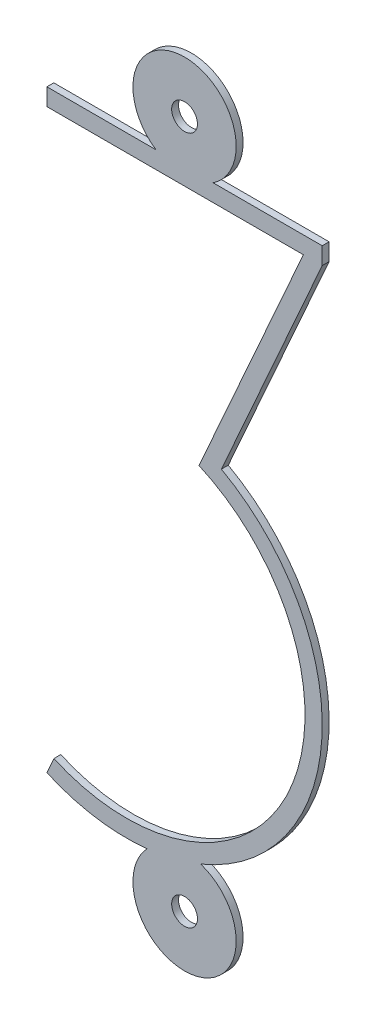
ISO-10303-21;
HEADER;
FILE_DESCRIPTION(('STEP AP214'),'2;1');
FILE_NAME('part.step','',(''),(''),'','','');
FILE_SCHEMA(('AUTOMOTIVE_DESIGN { 1 0 10303 214 1 1 1 1 }'));
ENDSEC;
DATA;
#1=APPLICATION_CONTEXT('core data for automotive mechanical design processes');
#2=APPLICATION_PROTOCOL_DEFINITION('international standard','automotive_design',2000,#1);
#3=PRODUCT_CONTEXT('',#1,'mechanical');
#4=PRODUCT('Part','Part','',(#3));
#5=PRODUCT_RELATED_PRODUCT_CATEGORY('part','',(#4));
#6=PRODUCT_DEFINITION_FORMATION('','',#4);
#7=PRODUCT_DEFINITION_CONTEXT('part definition',#1,'design');
#8=PRODUCT_DEFINITION('design','',#6,#7);
#9=PRODUCT_DEFINITION_SHAPE('','',#8);
#10=(LENGTH_UNIT() NAMED_UNIT(*) SI_UNIT(.MILLI.,.METRE.));
#11=(NAMED_UNIT(*) PLANE_ANGLE_UNIT() SI_UNIT($,.RADIAN.));
#12=(NAMED_UNIT(*) SI_UNIT($,.STERADIAN.) SOLID_ANGLE_UNIT());
#13=UNCERTAINTY_MEASURE_WITH_UNIT(LENGTH_MEASURE(1.E-05),#10,'distance_accuracy_value','');
#14=(GEOMETRIC_REPRESENTATION_CONTEXT(3) GLOBAL_UNCERTAINTY_ASSIGNED_CONTEXT((#13)) GLOBAL_UNIT_ASSIGNED_CONTEXT((#10,
#11,#12)) REPRESENTATION_CONTEXT('',''));
#15=CARTESIAN_POINT('',(0.,0.,0.));
#16=DIRECTION('',(0.,0.,1.));
#17=DIRECTION('',(1.,0.,0.));
#18=AXIS2_PLACEMENT_3D('',#15,#16,#17);
#19=CARTESIAN_POINT('',(-1.68855809367005,-3.31144190632995,0.1));
#20=DIRECTION('',(0.,0.,1.));
#21=DIRECTION('',(1.,0.,0.));
#22=AXIS2_PLACEMENT_3D('',#19,#20,#21);
#23=PLANE('',#22);
#24=CARTESIAN_POINT('',(0.,10.,0.1));
#25=DIRECTION('',(0.,0.,1.));
#26=DIRECTION('',(1.,0.,0.));
#27=AXIS2_PLACEMENT_3D('',#24,#25,#26);
#28=CIRCLE('',#27,0.375);
#29=CARTESIAN_POINT('',(0.375000000000002,10.,0.1));
#30=VERTEX_POINT('',#29);
#31=EDGE_CURVE('E165',#30,#30,#28,.T.);
#32=ORIENTED_EDGE('',*,*,#31,.F.);
#33=EDGE_LOOP('',(#32));
#34=FACE_BOUND('',#33,.T.);
#35=DIRECTION('',(0.,-1.,0.));
#36=VECTOR('',#35,1.);
#37=CARTESIAN_POINT('',(-4.,8.75,0.1));
#38=LINE('',#37,#36);
#39=CARTESIAN_POINT('',(-4.,8.75,0.1));
#40=VERTEX_POINT('',#39);
#41=CARTESIAN_POINT('',(-4.,8.25,0.1));
#42=VERTEX_POINT('',#41);
#43=EDGE_CURVE('E186',#40,#42,#38,.T.);
#44=ORIENTED_EDGE('',*,*,#43,.T.);
#45=DIRECTION('',(1.,0.,0.));
#46=VECTOR('',#45,1.);
#47=CARTESIAN_POINT('',(-4.,8.25,0.1));
#48=LINE('',#47,#46);
#49=CARTESIAN_POINT('',(3.45278977079677,8.25,0.1));
#50=VERTEX_POINT('',#49);
#51=EDGE_CURVE('E109',#42,#50,#48,.T.);
#52=ORIENTED_EDGE('',*,*,#51,.T.);
#53=DIRECTION('',(-0.406331774813376,-0.913725609128371,0.));
#54=VECTOR('',#53,1.);
#55=CARTESIAN_POINT('',(3.45278977079677,8.25,0.1));
#56=LINE('',#55,#54);
#57=CARTESIAN_POINT('',(0.419717925253206,1.42947649830665,0.1));
#58=VERTEX_POINT('',#57);
#59=EDGE_CURVE('E216',#50,#58,#56,.T.);
#60=ORIENTED_EDGE('',*,*,#59,.T.);
#61=CARTESIAN_POINT('',(-1.68855809367005,-3.31144190632995,0.1));
#62=DIRECTION('',(0.,0.,-1.));
#63=DIRECTION('',(1.,0.,0.));
#64=AXIS2_PLACEMENT_3D('',#61,#62,#63);
#65=CIRCLE('',#64,5.18855809367005);
#66=CARTESIAN_POINT('',(-3.79683411259331,-8.05236031096655,0.1));
#67=VERTEX_POINT('',#66);
#68=EDGE_CURVE('E235',#58,#67,#65,.T.);
#69=ORIENTED_EDGE('',*,*,#68,.T.);
#70=DIRECTION('',(-0.406331774813376,-0.913725609128371,0.));
#71=VECTOR('',#70,1.);
#72=CARTESIAN_POINT('',(-4.,-8.50922311553074,0.1));
#73=LINE('',#72,#71);
#74=CARTESIAN_POINT('',(-4.,-8.50922311553074,0.1));
#75=VERTEX_POINT('',#74);
#76=EDGE_CURVE('E232',#67,#75,#73,.T.);
#77=ORIENTED_EDGE('',*,*,#76,.T.);
#78=CARTESIAN_POINT('',(-1.68855809367005,-3.31144190632995,0.1));
#79=DIRECTION('',(0.,0.,1.));
#80=DIRECTION('',(1.,0.,0.));
#81=AXIS2_PLACEMENT_3D('',#78,#79,#80);
#82=CIRCLE('',#81,5.68855809367005);
#83=CARTESIAN_POINT('',(-1.08885039227427,-8.96830003235235,0.1));
#84=VERTEX_POINT('',#83);
#85=EDGE_CURVE('E234',#75,#84,#82,.T.);
#86=ORIENTED_EDGE('',*,*,#85,.T.);
#87=CARTESIAN_POINT('',(0.,-10.,0.1));
#88=DIRECTION('',(0.,0.,1.));
#89=DIRECTION('',(1.,0.,0.));
#90=AXIS2_PLACEMENT_3D('',#87,#88,#89);
#91=CIRCLE('',#90,1.5);
#92=CARTESIAN_POINT('',(0.468669320799945,-8.5750968216258,0.1));
#93=VERTEX_POINT('',#92);
#94=EDGE_CURVE('E237',#84,#93,#91,.T.);
#95=ORIENTED_EDGE('',*,*,#94,.T.);
#96=CARTESIAN_POINT('',(-1.68855809367005,-3.31144190632995,0.1));
#97=DIRECTION('',(0.,0.,1.));
#98=DIRECTION('',(1.,0.,0.));
#99=AXIS2_PLACEMENT_3D('',#96,#97,#98);
#100=CIRCLE('',#99,5.68855809367005);
#101=CARTESIAN_POINT('',(1.07080059765104,1.66305633949241,0.1));
#102=VERTEX_POINT('',#101);
#103=EDGE_CURVE('E243',#93,#102,#100,.T.);
#104=ORIENTED_EDGE('',*,*,#103,.T.);
#105=DIRECTION('',(0.406331774813376,0.913725609128371,0.));
#106=VECTOR('',#105,1.);
#107=CARTESIAN_POINT('',(4.,8.25,0.1));
#108=LINE('',#107,#106);
#109=CARTESIAN_POINT('',(4.,8.25,0.1));
#110=VERTEX_POINT('',#109);
#111=EDGE_CURVE('E245',#102,#110,#108,.T.);
#112=ORIENTED_EDGE('',*,*,#111,.T.);
#113=DIRECTION('',(0.,1.,0.));
#114=VECTOR('',#113,1.);
#115=CARTESIAN_POINT('',(4.,8.75,0.1));
#116=LINE('',#115,#114);
#117=CARTESIAN_POINT('',(4.,8.75,0.1));
#118=VERTEX_POINT('',#117);
#119=EDGE_CURVE('E143',#110,#118,#116,.T.);
#120=ORIENTED_EDGE('',*,*,#119,.T.);
#121=DIRECTION('',(-1.,0.,0.));
#122=VECTOR('',#121,1.);
#123=CARTESIAN_POINT('',(0.829156197588854,8.75,0.1));
#124=LINE('',#123,#122);
#125=CARTESIAN_POINT('',(0.829156197588853,8.75,0.1));
#126=VERTEX_POINT('',#125);
#127=EDGE_CURVE('E137',#118,#126,#124,.T.);
#128=ORIENTED_EDGE('',*,*,#127,.T.);
#129=CARTESIAN_POINT('',(0.,10.,0.1));
#130=DIRECTION('',(0.,0.,1.));
#131=DIRECTION('',(1.,0.,0.));
#132=AXIS2_PLACEMENT_3D('',#129,#130,#131);
#133=CIRCLE('',#132,1.5);
#134=CARTESIAN_POINT('',(-0.829156197588848,8.75,0.1));
#135=VERTEX_POINT('',#134);
#136=EDGE_CURVE('E141',#126,#135,#133,.T.);
#137=ORIENTED_EDGE('',*,*,#136,.T.);
#138=DIRECTION('',(-1.,0.,0.));
#139=VECTOR('',#138,1.);
#140=CARTESIAN_POINT('',(-4.,8.75,0.1));
#141=LINE('',#140,#139);
#142=EDGE_CURVE('E51',#135,#40,#141,.T.);
#143=ORIENTED_EDGE('',*,*,#142,.T.);
#144=EDGE_LOOP('',(#44,#52,#60,#69,#77,#86,#95,#104,#112,#120,#128,#137,#143));
#145=FACE_BOUND('',#144,.T.);
#146=CARTESIAN_POINT('',(0.,-10.,0.1));
#147=DIRECTION('',(0.,0.,1.));
#148=DIRECTION('',(1.,0.,0.));
#149=AXIS2_PLACEMENT_3D('',#146,#147,#148);
#150=CIRCLE('',#149,0.375);
#151=CARTESIAN_POINT('',(0.375,-10.,0.1));
#152=VERTEX_POINT('',#151);
#153=EDGE_CURVE('E287',#152,#152,#150,.T.);
#154=ORIENTED_EDGE('',*,*,#153,.F.);
#155=EDGE_LOOP('',(#154));
#156=FACE_BOUND('',#155,.T.);
#157=ADVANCED_FACE('F34',(#34,#145,#156),#23,.T.);
#158=CARTESIAN_POINT('',(-1.68855809367005,-3.31144190632995,-0.1));
#159=DIRECTION('',(0.,0.,1.));
#160=DIRECTION('',(1.,0.,0.));
#161=AXIS2_PLACEMENT_3D('',#158,#159,#160);
#162=PLANE('',#161);
#163=DIRECTION('',(0.,-1.,0.));
#164=VECTOR('',#163,1.);
#165=CARTESIAN_POINT('',(-4.,8.75,-0.1));
#166=LINE('',#165,#164);
#167=CARTESIAN_POINT('',(-4.,8.75,-0.1));
#168=VERTEX_POINT('',#167);
#169=CARTESIAN_POINT('',(-4.,8.25,-0.1));
#170=VERTEX_POINT('',#169);
#171=EDGE_CURVE('E161',#168,#170,#166,.T.);
#172=ORIENTED_EDGE('',*,*,#171,.F.);
#173=DIRECTION('',(-1.,0.,0.));
#174=VECTOR('',#173,1.);
#175=CARTESIAN_POINT('',(-4.,8.75,-0.1));
#176=LINE('',#175,#174);
#177=CARTESIAN_POINT('',(-0.829156197588848,8.75,-0.1));
#178=VERTEX_POINT('',#177);
#179=EDGE_CURVE('E101',#178,#168,#176,.T.);
#180=ORIENTED_EDGE('',*,*,#179,.F.);
#181=CARTESIAN_POINT('',(0.,10.,-0.1));
#182=DIRECTION('',(0.,0.,1.));
#183=DIRECTION('',(1.,0.,0.));
#184=AXIS2_PLACEMENT_3D('',#181,#182,#183);
#185=CIRCLE('',#184,1.5);
#186=CARTESIAN_POINT('',(0.829156197588853,8.75,-0.1));
#187=VERTEX_POINT('',#186);
#188=EDGE_CURVE('E95',#187,#178,#185,.T.);
#189=ORIENTED_EDGE('',*,*,#188,.F.);
#190=DIRECTION('',(-1.,0.,0.));
#191=VECTOR('',#190,1.);
#192=CARTESIAN_POINT('',(0.829156197588854,8.75,-0.1));
#193=LINE('',#192,#191);
#194=CARTESIAN_POINT('',(4.,8.75,-0.1));
#195=VERTEX_POINT('',#194);
#196=EDGE_CURVE('E151',#195,#187,#193,.T.);
#197=ORIENTED_EDGE('',*,*,#196,.F.);
#198=DIRECTION('',(0.,1.,0.));
#199=VECTOR('',#198,1.);
#200=CARTESIAN_POINT('',(4.,8.75,-0.1));
#201=LINE('',#200,#199);
#202=CARTESIAN_POINT('',(4.,8.25,-0.1));
#203=VERTEX_POINT('',#202);
#204=EDGE_CURVE('E181',#203,#195,#201,.T.);
#205=ORIENTED_EDGE('',*,*,#204,.F.);
#206=DIRECTION('',(0.406331774813376,0.913725609128371,0.));
#207=VECTOR('',#206,1.);
#208=CARTESIAN_POINT('',(4.,8.25,-0.1));
#209=LINE('',#208,#207);
#210=CARTESIAN_POINT('',(1.07080059765104,1.66305633949241,-0.1));
#211=VERTEX_POINT('',#210);
#212=EDGE_CURVE('E179',#211,#203,#209,.T.);
#213=ORIENTED_EDGE('',*,*,#212,.F.);
#214=CARTESIAN_POINT('',(-1.68855809367005,-3.31144190632995,-0.1));
#215=DIRECTION('',(0.,0.,1.));
#216=DIRECTION('',(1.,0.,0.));
#217=AXIS2_PLACEMENT_3D('',#214,#215,#216);
#218=CIRCLE('',#217,5.68855809367005);
#219=CARTESIAN_POINT('',(0.468669320799945,-8.5750968216258,-0.1));
#220=VERTEX_POINT('',#219);
#221=EDGE_CURVE('E177',#220,#211,#218,.T.);
#222=ORIENTED_EDGE('',*,*,#221,.F.);
#223=CARTESIAN_POINT('',(0.,-10.,-0.1));
#224=DIRECTION('',(0.,0.,1.));
#225=DIRECTION('',(1.,0.,0.));
#226=AXIS2_PLACEMENT_3D('',#223,#224,#225);
#227=CIRCLE('',#226,1.5);
#228=CARTESIAN_POINT('',(-1.08885039227427,-8.96830003235235,-0.1));
#229=VERTEX_POINT('',#228);
#230=EDGE_CURVE('E175',#229,#220,#227,.T.);
#231=ORIENTED_EDGE('',*,*,#230,.F.);
#232=CARTESIAN_POINT('',(-1.68855809367005,-3.31144190632995,-0.1));
#233=DIRECTION('',(0.,0.,1.));
#234=DIRECTION('',(1.,0.,0.));
#235=AXIS2_PLACEMENT_3D('',#232,#233,#234);
#236=CIRCLE('',#235,5.68855809367005);
#237=CARTESIAN_POINT('',(-4.,-8.50922311553074,-0.1));
#238=VERTEX_POINT('',#237);
#239=EDGE_CURVE('E173',#238,#229,#236,.T.);
#240=ORIENTED_EDGE('',*,*,#239,.F.);
#241=DIRECTION('',(-0.406331774813376,-0.913725609128371,0.));
#242=VECTOR('',#241,1.);
#243=CARTESIAN_POINT('',(-4.,-8.50922311553074,-0.1));
#244=LINE('',#243,#242);
#245=CARTESIAN_POINT('',(-3.79683411259331,-8.05236031096655,-0.1));
#246=VERTEX_POINT('',#245);
#247=EDGE_CURVE('E171',#246,#238,#244,.T.);
#248=ORIENTED_EDGE('',*,*,#247,.F.);
#249=CARTESIAN_POINT('',(-1.68855809367005,-3.31144190632995,-0.1));
#250=DIRECTION('',(0.,0.,-1.));
#251=DIRECTION('',(1.,0.,0.));
#252=AXIS2_PLACEMENT_3D('',#249,#250,#251);
#253=CIRCLE('',#252,5.18855809367005);
#254=CARTESIAN_POINT('',(0.419717925253206,1.42947649830665,-0.1));
#255=VERTEX_POINT('',#254);
#256=EDGE_CURVE('E169',#255,#246,#253,.T.);
#257=ORIENTED_EDGE('',*,*,#256,.F.);
#258=DIRECTION('',(-0.406331774813376,-0.913725609128371,0.));
#259=VECTOR('',#258,1.);
#260=CARTESIAN_POINT('',(3.45278977079677,8.25,-0.1));
#261=LINE('',#260,#259);
#262=CARTESIAN_POINT('',(3.45278977079677,8.25,-0.1));
#263=VERTEX_POINT('',#262);
#264=EDGE_CURVE('E167',#263,#255,#261,.T.);
#265=ORIENTED_EDGE('',*,*,#264,.F.);
#266=DIRECTION('',(1.,0.,0.));
#267=VECTOR('',#266,1.);
#268=CARTESIAN_POINT('',(-4.,8.25,-0.1));
#269=LINE('',#268,#267);
#270=EDGE_CURVE('E164',#170,#263,#269,.T.);
#271=ORIENTED_EDGE('',*,*,#270,.F.);
#272=EDGE_LOOP('',(#172,#180,#189,#197,#205,#213,#222,#231,#240,#248,#257,#265,#271));
#273=FACE_BOUND('',#272,.T.);
#274=CARTESIAN_POINT('',(0.,10.,-0.1));
#275=DIRECTION('',(0.,0.,1.));
#276=DIRECTION('',(1.,0.,0.));
#277=AXIS2_PLACEMENT_3D('',#274,#275,#276);
#278=CIRCLE('',#277,0.375);
#279=CARTESIAN_POINT('',(0.375000000000002,10.,-0.1));
#280=VERTEX_POINT('',#279);
#281=EDGE_CURVE('E293',#280,#280,#278,.T.);
#282=ORIENTED_EDGE('',*,*,#281,.T.);
#283=EDGE_LOOP('',(#282));
#284=FACE_BOUND('',#283,.T.);
#285=CARTESIAN_POINT('',(0.,-10.,-0.1));
#286=DIRECTION('',(0.,0.,1.));
#287=DIRECTION('',(1.,0.,0.));
#288=AXIS2_PLACEMENT_3D('',#285,#286,#287);
#289=CIRCLE('',#288,0.375);
#290=CARTESIAN_POINT('',(0.375,-10.,-0.1));
#291=VERTEX_POINT('',#290);
#292=EDGE_CURVE('E290',#291,#291,#289,.T.);
#293=ORIENTED_EDGE('',*,*,#292,.T.);
#294=EDGE_LOOP('',(#293));
#295=FACE_BOUND('',#294,.T.);
#296=ADVANCED_FACE('F220',(#273,#284,#295),#162,.F.);
#297=CARTESIAN_POINT('',(-4.,8.75,0.1));
#298=DIRECTION('',(1.,0.,0.));
#299=DIRECTION('',(0.,0.,-1.));
#300=AXIS2_PLACEMENT_3D('',#297,#298,#299);
#301=PLANE('',#300);
#302=ORIENTED_EDGE('',*,*,#171,.T.);
#303=DIRECTION('',(0.,0.,-1.));
#304=VECTOR('',#303,1.);
#305=CARTESIAN_POINT('',(-4.,8.25,0.1));
#306=LINE('',#305,#304);
#307=EDGE_CURVE('E11',#42,#170,#306,.T.);
#308=ORIENTED_EDGE('',*,*,#307,.F.);
#309=ORIENTED_EDGE('',*,*,#43,.F.);
#310=DIRECTION('',(0.,0.,-1.));
#311=VECTOR('',#310,1.);
#312=CARTESIAN_POINT('',(-4.,8.75,0.1));
#313=LINE('',#312,#311);
#314=EDGE_CURVE('E157',#40,#168,#313,.T.);
#315=ORIENTED_EDGE('',*,*,#314,.T.);
#316=EDGE_LOOP('',(#302,#308,#309,#315));
#317=FACE_BOUND('',#316,.T.);
#318=ADVANCED_FACE('F36',(#317),#301,.F.);
#319=CARTESIAN_POINT('',(-4.,8.25,0.1));
#320=DIRECTION('',(0.,1.,0.));
#321=DIRECTION('',(-1.,0.,0.));
#322=AXIS2_PLACEMENT_3D('',#319,#320,#321);
#323=PLANE('',#322);
#324=ORIENTED_EDGE('',*,*,#270,.T.);
#325=DIRECTION('',(0.,0.,-1.));
#326=VECTOR('',#325,1.);
#327=CARTESIAN_POINT('',(3.45278977079677,8.25,0.1));
#328=LINE('',#327,#326);
#329=EDGE_CURVE('E43',#50,#263,#328,.T.);
#330=ORIENTED_EDGE('',*,*,#329,.F.);
#331=ORIENTED_EDGE('',*,*,#51,.F.);
#332=ORIENTED_EDGE('',*,*,#307,.T.);
#333=EDGE_LOOP('',(#324,#330,#331,#332));
#334=FACE_BOUND('',#333,.T.);
#335=ADVANCED_FACE('F396',(#334),#323,.F.);
#336=CARTESIAN_POINT('',(3.45278977079677,8.25,0.1));
#337=DIRECTION('',(0.913725609128371,-0.406331774813376,0.));
#338=DIRECTION('',(0.406331774813376,0.913725609128371,0.));
#339=AXIS2_PLACEMENT_3D('',#336,#337,#338);
#340=PLANE('',#339);
#341=ORIENTED_EDGE('',*,*,#264,.T.);
#342=DIRECTION('',(0.,0.,-1.));
#343=VECTOR('',#342,1.);
#344=CARTESIAN_POINT('',(0.419717925253206,1.42947649830665,0.1));
#345=LINE('',#344,#343);
#346=EDGE_CURVE('E208',#58,#255,#345,.T.);
#347=ORIENTED_EDGE('',*,*,#346,.F.);
#348=ORIENTED_EDGE('',*,*,#59,.F.);
#349=ORIENTED_EDGE('',*,*,#329,.T.);
#350=EDGE_LOOP('',(#341,#347,#348,#349));
#351=FACE_BOUND('',#350,.T.);
#352=ADVANCED_FACE('F214',(#351),#340,.F.);
#353=CARTESIAN_POINT('',(-1.68855809367005,-3.31144190632995,0.1));
#354=DIRECTION('',(0.,0.,-1.));
#355=DIRECTION('',(-1.,0.,0.));
#356=AXIS2_PLACEMENT_3D('',#353,#354,#355);
#357=CYLINDRICAL_SURFACE('',#356,5.18855809367005);
#358=ORIENTED_EDGE('',*,*,#256,.T.);
#359=DIRECTION('',(0.,0.,-1.));
#360=VECTOR('',#359,1.);
#361=CARTESIAN_POINT('',(-3.79683411259331,-8.05236031096655,0.1));
#362=LINE('',#361,#360);
#363=EDGE_CURVE('E205',#67,#246,#362,.T.);
#364=ORIENTED_EDGE('',*,*,#363,.F.);
#365=ORIENTED_EDGE('',*,*,#68,.F.);
#366=ORIENTED_EDGE('',*,*,#346,.T.);
#367=EDGE_LOOP('',(#358,#364,#365,#366));
#368=FACE_BOUND('',#367,.T.);
#369=ADVANCED_FACE('F226',(#368),#357,.F.);
#370=CARTESIAN_POINT('',(-4.,-8.50922311553074,0.1));
#371=DIRECTION('',(0.913725609128371,-0.406331774813376,0.));
#372=DIRECTION('',(0.406331774813376,0.913725609128371,0.));
#373=AXIS2_PLACEMENT_3D('',#370,#371,#372);
#374=PLANE('',#373);
#375=ORIENTED_EDGE('',*,*,#247,.T.);
#376=DIRECTION('',(0.,0.,-1.));
#377=VECTOR('',#376,1.);
#378=CARTESIAN_POINT('',(-4.,-8.50922311553074,0.1));
#379=LINE('',#378,#377);
#380=EDGE_CURVE('E202',#75,#238,#379,.T.);
#381=ORIENTED_EDGE('',*,*,#380,.F.);
#382=ORIENTED_EDGE('',*,*,#76,.F.);
#383=ORIENTED_EDGE('',*,*,#363,.T.);
#384=EDGE_LOOP('',(#375,#381,#382,#383));
#385=FACE_BOUND('',#384,.T.);
#386=ADVANCED_FACE('F230',(#385),#374,.F.);
#387=CARTESIAN_POINT('',(-1.68855809367005,-3.31144190632995,0.1));
#388=DIRECTION('',(0.,0.,-1.));
#389=DIRECTION('',(-1.,0.,0.));
#390=AXIS2_PLACEMENT_3D('',#387,#388,#389);
#391=CYLINDRICAL_SURFACE('',#390,5.68855809367005);
#392=ORIENTED_EDGE('',*,*,#239,.T.);
#393=DIRECTION('',(0.,0.,-1.));
#394=VECTOR('',#393,1.);
#395=CARTESIAN_POINT('',(-1.08885039227427,-8.96830003235235,0.1));
#396=LINE('',#395,#394);
#397=EDGE_CURVE('E199',#84,#229,#396,.T.);
#398=ORIENTED_EDGE('',*,*,#397,.F.);
#399=ORIENTED_EDGE('',*,*,#85,.F.);
#400=ORIENTED_EDGE('',*,*,#380,.T.);
#401=EDGE_LOOP('',(#392,#398,#399,#400));
#402=FACE_BOUND('',#401,.T.);
#403=ADVANCED_FACE('F361',(#402),#391,.T.);
#404=CARTESIAN_POINT('',(0.,-10.,0.1));
#405=DIRECTION('',(0.,0.,-1.));
#406=DIRECTION('',(-1.,0.,0.));
#407=AXIS2_PLACEMENT_3D('',#404,#405,#406);
#408=CYLINDRICAL_SURFACE('',#407,1.5);
#409=ORIENTED_EDGE('',*,*,#230,.T.);
#410=DIRECTION('',(0.,0.,-1.));
#411=VECTOR('',#410,1.);
#412=CARTESIAN_POINT('',(0.468669320799945,-8.5750968216258,0.1));
#413=LINE('',#412,#411);
#414=EDGE_CURVE('E196',#93,#220,#413,.T.);
#415=ORIENTED_EDGE('',*,*,#414,.F.);
#416=ORIENTED_EDGE('',*,*,#94,.F.);
#417=ORIENTED_EDGE('',*,*,#397,.T.);
#418=EDGE_LOOP('',(#409,#415,#416,#417));
#419=FACE_BOUND('',#418,.T.);
#420=ADVANCED_FACE('F351',(#419),#408,.T.);
#421=CARTESIAN_POINT('',(-1.68855809367005,-3.31144190632995,0.1));
#422=DIRECTION('',(0.,0.,-1.));
#423=DIRECTION('',(-1.,0.,0.));
#424=AXIS2_PLACEMENT_3D('',#421,#422,#423);
#425=CYLINDRICAL_SURFACE('',#424,5.68855809367005);
#426=ORIENTED_EDGE('',*,*,#221,.T.);
#427=DIRECTION('',(0.,0.,-1.));
#428=VECTOR('',#427,1.);
#429=CARTESIAN_POINT('',(1.07080059765104,1.66305633949241,0.1));
#430=LINE('',#429,#428);
#431=EDGE_CURVE('E193',#102,#211,#430,.T.);
#432=ORIENTED_EDGE('',*,*,#431,.F.);
#433=ORIENTED_EDGE('',*,*,#103,.F.);
#434=ORIENTED_EDGE('',*,*,#414,.T.);
#435=EDGE_LOOP('',(#426,#432,#433,#434));
#436=FACE_BOUND('',#435,.T.);
#437=ADVANCED_FACE('F342',(#436),#425,.T.);
#438=CARTESIAN_POINT('',(4.,8.25,0.1));
#439=DIRECTION('',(-0.913725609128371,0.406331774813376,0.));
#440=DIRECTION('',(-0.406331774813376,-0.913725609128371,0.));
#441=AXIS2_PLACEMENT_3D('',#438,#439,#440);
#442=PLANE('',#441);
#443=ORIENTED_EDGE('',*,*,#212,.T.);
#444=DIRECTION('',(0.,0.,-1.));
#445=VECTOR('',#444,1.);
#446=CARTESIAN_POINT('',(4.,8.25,0.1));
#447=LINE('',#446,#445);
#448=EDGE_CURVE('E190',#110,#203,#447,.T.);
#449=ORIENTED_EDGE('',*,*,#448,.F.);
#450=ORIENTED_EDGE('',*,*,#111,.F.);
#451=ORIENTED_EDGE('',*,*,#431,.T.);
#452=EDGE_LOOP('',(#443,#449,#450,#451));
#453=FACE_BOUND('',#452,.T.);
#454=ADVANCED_FACE('F251',(#453),#442,.F.);
#455=CARTESIAN_POINT('',(4.,8.75,0.1));
#456=DIRECTION('',(-1.,0.,0.));
#457=DIRECTION('',(0.,0.,1.));
#458=AXIS2_PLACEMENT_3D('',#455,#456,#457);
#459=PLANE('',#458);
#460=ORIENTED_EDGE('',*,*,#204,.T.);
#461=DIRECTION('',(0.,0.,-1.));
#462=VECTOR('',#461,1.);
#463=CARTESIAN_POINT('',(4.,8.75,0.1));
#464=LINE('',#463,#462);
#465=EDGE_CURVE('E152',#118,#195,#464,.T.);
#466=ORIENTED_EDGE('',*,*,#465,.F.);
#467=ORIENTED_EDGE('',*,*,#119,.F.);
#468=ORIENTED_EDGE('',*,*,#448,.T.);
#469=EDGE_LOOP('',(#460,#466,#467,#468));
#470=FACE_BOUND('',#469,.T.);
#471=ADVANCED_FACE('F255',(#470),#459,.F.);
#472=CARTESIAN_POINT('',(0.829156197588854,8.75,0.1));
#473=DIRECTION('',(0.,-1.,0.));
#474=DIRECTION('',(0.,0.,-1.));
#475=AXIS2_PLACEMENT_3D('',#472,#473,#474);
#476=PLANE('',#475);
#477=ORIENTED_EDGE('',*,*,#196,.T.);
#478=DIRECTION('',(0.,0.,-1.));
#479=VECTOR('',#478,1.);
#480=CARTESIAN_POINT('',(0.829156197588853,8.75,0.1));
#481=LINE('',#480,#479);
#482=EDGE_CURVE('E148',#126,#187,#481,.T.);
#483=ORIENTED_EDGE('',*,*,#482,.F.);
#484=ORIENTED_EDGE('',*,*,#127,.F.);
#485=ORIENTED_EDGE('',*,*,#465,.T.);
#486=EDGE_LOOP('',(#477,#483,#484,#485));
#487=FACE_BOUND('',#486,.T.);
#488=ADVANCED_FACE('F149',(#487),#476,.F.);
#489=CARTESIAN_POINT('',(0.,10.,0.1));
#490=DIRECTION('',(0.,0.,-1.));
#491=DIRECTION('',(-1.,0.,0.));
#492=AXIS2_PLACEMENT_3D('',#489,#490,#491);
#493=CYLINDRICAL_SURFACE('',#492,1.5);
#494=ORIENTED_EDGE('',*,*,#188,.T.);
#495=DIRECTION('',(0.,0.,-1.));
#496=VECTOR('',#495,1.);
#497=CARTESIAN_POINT('',(-0.829156197588848,8.75,0.1));
#498=LINE('',#497,#496);
#499=EDGE_CURVE('E153',#135,#178,#498,.T.);
#500=ORIENTED_EDGE('',*,*,#499,.F.);
#501=ORIENTED_EDGE('',*,*,#136,.F.);
#502=ORIENTED_EDGE('',*,*,#482,.T.);
#503=EDGE_LOOP('',(#494,#500,#501,#502));
#504=FACE_BOUND('',#503,.T.);
#505=ADVANCED_FACE('F155',(#504),#493,.T.);
#506=CARTESIAN_POINT('',(-4.,8.75,0.1));
#507=DIRECTION('',(0.,-1.,0.));
#508=DIRECTION('',(1.,0.,0.));
#509=AXIS2_PLACEMENT_3D('',#506,#507,#508);
#510=PLANE('',#509);
#511=ORIENTED_EDGE('',*,*,#179,.T.);
#512=ORIENTED_EDGE('',*,*,#314,.F.);
#513=ORIENTED_EDGE('',*,*,#142,.F.);
#514=ORIENTED_EDGE('',*,*,#499,.T.);
#515=EDGE_LOOP('',(#511,#512,#513,#514));
#516=FACE_BOUND('',#515,.T.);
#517=ADVANCED_FACE('F259',(#516),#510,.F.);
#518=CARTESIAN_POINT('',(0.,10.,0.1));
#519=DIRECTION('',(0.,0.,-1.));
#520=DIRECTION('',(-1.,0.,0.));
#521=AXIS2_PLACEMENT_3D('',#518,#519,#520);
#522=CYLINDRICAL_SURFACE('',#521,0.375);
#523=ORIENTED_EDGE('',*,*,#31,.T.);
#524=EDGE_LOOP('',(#523));
#525=FACE_BOUND('',#524,.T.);
#526=ORIENTED_EDGE('',*,*,#281,.F.);
#527=EDGE_LOOP('',(#526));
#528=FACE_BOUND('',#527,.T.);
#529=ADVANCED_FACE('F261',(#525,#528),#522,.F.);
#530=CARTESIAN_POINT('',(0.,-10.,0.1));
#531=DIRECTION('',(0.,0.,-1.));
#532=DIRECTION('',(-1.,0.,0.));
#533=AXIS2_PLACEMENT_3D('',#530,#531,#532);
#534=CYLINDRICAL_SURFACE('',#533,0.375);
#535=ORIENTED_EDGE('',*,*,#153,.T.);
#536=EDGE_LOOP('',(#535));
#537=FACE_BOUND('',#536,.T.);
#538=ORIENTED_EDGE('',*,*,#292,.F.);
#539=EDGE_LOOP('',(#538));
#540=FACE_BOUND('',#539,.T.);
#541=ADVANCED_FACE('F267',(#537,#540),#534,.F.);
#542=CLOSED_SHELL('',(#157,#296,#318,#335,#352,#369,#386,#403,#420,#437,#454,#471,#488,#505,
#517,#529,#541));
#543=MANIFOLD_SOLID_BREP('B2',#542);
#544=ADVANCED_BREP_SHAPE_REPRESENTATION('',(#18,#543),#14);
#545=SHAPE_DEFINITION_REPRESENTATION(#9,#544);
ENDSEC;
END-ISO-10303-21;
